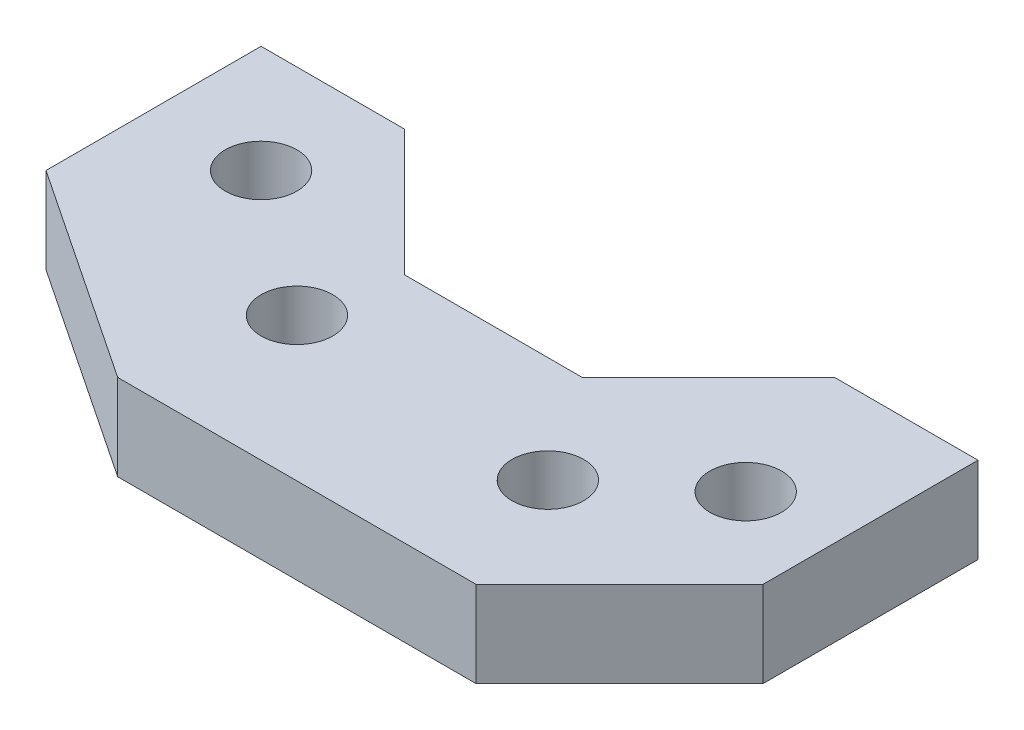
ISO-10303-21;
HEADER;
FILE_DESCRIPTION(('STEP AP214'),'2;1');
FILE_NAME('part.step','',(''),(''),'','','');
FILE_SCHEMA(('AUTOMOTIVE_DESIGN { 1 0 10303 214 1 1 1 1 }'));
ENDSEC;
DATA;
#1=APPLICATION_CONTEXT('core data for automotive mechanical design processes');
#2=APPLICATION_PROTOCOL_DEFINITION('international standard','automotive_design',2000,#1);
#3=PRODUCT_CONTEXT('',#1,'mechanical');
#4=PRODUCT('Part','Part','',(#3));
#5=PRODUCT_RELATED_PRODUCT_CATEGORY('part','',(#4));
#6=PRODUCT_DEFINITION_FORMATION('','',#4);
#7=PRODUCT_DEFINITION_CONTEXT('part definition',#1,'design');
#8=PRODUCT_DEFINITION('design','',#6,#7);
#9=PRODUCT_DEFINITION_SHAPE('','',#8);
#10=(LENGTH_UNIT() NAMED_UNIT(*) SI_UNIT(.MILLI.,.METRE.));
#11=(NAMED_UNIT(*) PLANE_ANGLE_UNIT() SI_UNIT($,.RADIAN.));
#12=(NAMED_UNIT(*) SI_UNIT($,.STERADIAN.) SOLID_ANGLE_UNIT());
#13=UNCERTAINTY_MEASURE_WITH_UNIT(LENGTH_MEASURE(1.E-05),#10,'distance_accuracy_value','');
#14=(GEOMETRIC_REPRESENTATION_CONTEXT(3) GLOBAL_UNCERTAINTY_ASSIGNED_CONTEXT((#13)) GLOBAL_UNIT_ASSIGNED_CONTEXT((#10,
#11,#12)) REPRESENTATION_CONTEXT('',''));
#15=CARTESIAN_POINT('',(0.,0.,0.));
#16=DIRECTION('',(0.,0.,1.));
#17=DIRECTION('',(1.,0.,0.));
#18=AXIS2_PLACEMENT_3D('',#15,#16,#17);
#19=CARTESIAN_POINT('',(0.,15.24,0.));
#20=DIRECTION('',(0.,-1.,0.));
#21=DIRECTION('',(0.,0.,-1.));
#22=AXIS2_PLACEMENT_3D('',#19,#20,#21);
#23=PLANE('',#22);
#24=DIRECTION('',(-1.,0.,0.));
#25=VECTOR('',#24,1.);
#26=CARTESIAN_POINT('',(0.,15.24,0.));
#27=LINE('',#26,#25);
#28=CARTESIAN_POINT('',(25.4,15.24,0.));
#29=VERTEX_POINT('',#28);
#30=CARTESIAN_POINT('',(0.,15.24,0.));
#31=VERTEX_POINT('',#30);
#32=EDGE_CURVE('E164',#29,#31,#27,.T.);
#33=ORIENTED_EDGE('',*,*,#32,.T.);
#34=DIRECTION('',(0.,0.,1.));
#35=VECTOR('',#34,1.);
#36=CARTESIAN_POINT('',(0.,15.24,0.));
#37=LINE('',#36,#35);
#38=CARTESIAN_POINT('',(0.,15.24,38.1));
#39=VERTEX_POINT('',#38);
#40=EDGE_CURVE('E102',#31,#39,#37,.T.);
#41=ORIENTED_EDGE('',*,*,#40,.T.);
#42=DIRECTION('',(0.832050294337844,0.,0.554700196225229));
#43=VECTOR('',#42,1.);
#44=CARTESIAN_POINT('',(0.,15.24,38.1));
#45=LINE('',#44,#43);
#46=CARTESIAN_POINT('',(38.1,15.24,63.5));
#47=VERTEX_POINT('',#46);
#48=EDGE_CURVE('E185',#39,#47,#45,.T.);
#49=ORIENTED_EDGE('',*,*,#48,.T.);
#50=DIRECTION('',(1.,0.,0.));
#51=VECTOR('',#50,1.);
#52=CARTESIAN_POINT('',(38.1,15.24,63.5));
#53=LINE('',#52,#51);
#54=CARTESIAN_POINT('',(101.6,15.24,63.5));
#55=VERTEX_POINT('',#54);
#56=EDGE_CURVE('E204',#47,#55,#53,.T.);
#57=ORIENTED_EDGE('',*,*,#56,.T.);
#58=DIRECTION('',(0.707106781186546,0.,-0.707106781186548));
#59=VECTOR('',#58,1.);
#60=CARTESIAN_POINT('',(101.6,15.24,63.5));
#61=LINE('',#60,#59);
#62=CARTESIAN_POINT('',(127.,15.24,38.1));
#63=VERTEX_POINT('',#62);
#64=EDGE_CURVE('E201',#55,#63,#61,.T.);
#65=ORIENTED_EDGE('',*,*,#64,.T.);
#66=DIRECTION('',(0.,0.,-1.));
#67=VECTOR('',#66,1.);
#68=CARTESIAN_POINT('',(127.,15.24,0.));
#69=LINE('',#68,#67);
#70=CARTESIAN_POINT('',(127.,15.24,0.));
#71=VERTEX_POINT('',#70);
#72=EDGE_CURVE('E203',#63,#71,#69,.T.);
#73=ORIENTED_EDGE('',*,*,#72,.T.);
#74=DIRECTION('',(-1.,0.,0.));
#75=VECTOR('',#74,1.);
#76=CARTESIAN_POINT('',(127.,15.24,0.));
#77=LINE('',#76,#75);
#78=CARTESIAN_POINT('',(101.6,15.24,0.));
#79=VERTEX_POINT('',#78);
#80=EDGE_CURVE('E127',#71,#79,#77,.T.);
#81=ORIENTED_EDGE('',*,*,#80,.T.);
#82=DIRECTION('',(-0.707106781186548,0.,0.707106781186547));
#83=VECTOR('',#82,1.);
#84=CARTESIAN_POINT('',(79.248,15.24,22.352));
#85=LINE('',#84,#83);
#86=CARTESIAN_POINT('',(79.248,15.24,22.352));
#87=VERTEX_POINT('',#86);
#88=EDGE_CURVE('E121',#79,#87,#85,.T.);
#89=ORIENTED_EDGE('',*,*,#88,.T.);
#90=DIRECTION('',(-1.,0.,0.));
#91=VECTOR('',#90,1.);
#92=CARTESIAN_POINT('',(47.752,15.24,22.352));
#93=LINE('',#92,#91);
#94=CARTESIAN_POINT('',(47.752,15.24,22.352));
#95=VERTEX_POINT('',#94);
#96=EDGE_CURVE('E125',#87,#95,#93,.T.);
#97=ORIENTED_EDGE('',*,*,#96,.T.);
#98=DIRECTION('',(-0.707106781186547,0.,-0.707106781186547));
#99=VECTOR('',#98,1.);
#100=CARTESIAN_POINT('',(25.4,15.24,0.));
#101=LINE('',#100,#99);
#102=EDGE_CURVE('E53',#95,#29,#101,.T.);
#103=ORIENTED_EDGE('',*,*,#102,.T.);
#104=EDGE_LOOP('',(#33,#41,#49,#57,#65,#73,#81,#89,#97,#103));
#105=FACE_BOUND('',#104,.T.);
#106=CARTESIAN_POINT('',(111.252,15.24,25.4));
#107=DIRECTION('',(0.,1.,0.));
#108=DIRECTION('',(0.,0.,1.));
#109=AXIS2_PLACEMENT_3D('',#106,#107,#108);
#110=CIRCLE('',#109,6.35);
#111=CARTESIAN_POINT('',(111.252,15.24,31.75));
#112=VERTEX_POINT('',#111);
#113=EDGE_CURVE('E149',#112,#112,#110,.T.);
#114=ORIENTED_EDGE('',*,*,#113,.F.);
#115=EDGE_LOOP('',(#114));
#116=FACE_BOUND('',#115,.T.);
#117=CARTESIAN_POINT('',(19.05,15.24,19.05));
#118=DIRECTION('',(0.,1.,0.));
#119=DIRECTION('',(0.,0.,1.));
#120=AXIS2_PLACEMENT_3D('',#117,#118,#119);
#121=CIRCLE('',#120,6.35);
#122=CARTESIAN_POINT('',(19.05,15.24,25.4));
#123=VERTEX_POINT('',#122);
#124=EDGE_CURVE('E215',#123,#123,#121,.T.);
#125=ORIENTED_EDGE('',*,*,#124,.F.);
#126=EDGE_LOOP('',(#125));
#127=FACE_BOUND('',#126,.T.);
#128=CARTESIAN_POINT('',(44.45,15.24,38.1));
#129=DIRECTION('',(0.,1.,0.));
#130=DIRECTION('',(0.,0.,1.));
#131=AXIS2_PLACEMENT_3D('',#128,#129,#130);
#132=CIRCLE('',#131,6.35);
#133=CARTESIAN_POINT('',(44.45,15.24,44.45));
#134=VERTEX_POINT('',#133);
#135=EDGE_CURVE('E221',#134,#134,#132,.T.);
#136=ORIENTED_EDGE('',*,*,#135,.F.);
#137=EDGE_LOOP('',(#136));
#138=FACE_BOUND('',#137,.T.);
#139=CARTESIAN_POINT('',(91.948,15.24,41.148));
#140=DIRECTION('',(0.,1.,0.));
#141=DIRECTION('',(0.,0.,1.));
#142=AXIS2_PLACEMENT_3D('',#139,#140,#141);
#143=CIRCLE('',#142,6.35);
#144=CARTESIAN_POINT('',(91.948,15.24,47.498));
#145=VERTEX_POINT('',#144);
#146=EDGE_CURVE('E227',#145,#145,#143,.T.);
#147=ORIENTED_EDGE('',*,*,#146,.F.);
#148=EDGE_LOOP('',(#147));
#149=FACE_BOUND('',#148,.T.);
#150=ADVANCED_FACE('F36',(#105,#116,#127,#138,#149),#23,.F.);
#151=CARTESIAN_POINT('',(0.,0.,0.));
#152=DIRECTION('',(0.,-1.,0.));
#153=DIRECTION('',(0.,0.,-1.));
#154=AXIS2_PLACEMENT_3D('',#151,#152,#153);
#155=PLANE('',#154);
#156=CARTESIAN_POINT('',(44.45,0.,38.1));
#157=DIRECTION('',(0.,1.,0.));
#158=DIRECTION('',(0.,0.,1.));
#159=AXIS2_PLACEMENT_3D('',#156,#157,#158);
#160=CIRCLE('',#159,6.35);
#161=CARTESIAN_POINT('',(44.45,0.,44.45));
#162=VERTEX_POINT('',#161);
#163=EDGE_CURVE('E224',#162,#162,#160,.T.);
#164=ORIENTED_EDGE('',*,*,#163,.T.);
#165=EDGE_LOOP('',(#164));
#166=FACE_BOUND('',#165,.T.);
#167=CARTESIAN_POINT('',(111.252,0.,25.4));
#168=DIRECTION('',(0.,1.,0.));
#169=DIRECTION('',(0.,0.,1.));
#170=AXIS2_PLACEMENT_3D('',#167,#168,#169);
#171=CIRCLE('',#170,6.35);
#172=CARTESIAN_POINT('',(111.252,0.,31.75));
#173=VERTEX_POINT('',#172);
#174=EDGE_CURVE('E212',#173,#173,#171,.T.);
#175=ORIENTED_EDGE('',*,*,#174,.T.);
#176=EDGE_LOOP('',(#175));
#177=FACE_BOUND('',#176,.T.);
#178=DIRECTION('',(-1.,0.,0.));
#179=VECTOR('',#178,1.);
#180=CARTESIAN_POINT('',(0.,0.,0.));
#181=LINE('',#180,#179);
#182=CARTESIAN_POINT('',(25.4,0.,0.));
#183=VERTEX_POINT('',#182);
#184=CARTESIAN_POINT('',(0.,0.,0.));
#185=VERTEX_POINT('',#184);
#186=EDGE_CURVE('E145',#183,#185,#181,.T.);
#187=ORIENTED_EDGE('',*,*,#186,.F.);
#188=DIRECTION('',(-0.707106781186547,0.,-0.707106781186547));
#189=VECTOR('',#188,1.);
#190=CARTESIAN_POINT('',(25.4,0.,0.));
#191=LINE('',#190,#189);
#192=CARTESIAN_POINT('',(47.752,0.,22.352));
#193=VERTEX_POINT('',#192);
#194=EDGE_CURVE('E94',#193,#183,#191,.T.);
#195=ORIENTED_EDGE('',*,*,#194,.F.);
#196=DIRECTION('',(-1.,0.,0.));
#197=VECTOR('',#196,1.);
#198=CARTESIAN_POINT('',(47.752,0.,22.352));
#199=LINE('',#198,#197);
#200=CARTESIAN_POINT('',(79.248,0.,22.352));
#201=VERTEX_POINT('',#200);
#202=EDGE_CURVE('E88',#201,#193,#199,.T.);
#203=ORIENTED_EDGE('',*,*,#202,.F.);
#204=DIRECTION('',(-0.707106781186548,0.,0.707106781186547));
#205=VECTOR('',#204,1.);
#206=CARTESIAN_POINT('',(79.248,0.,22.352));
#207=LINE('',#206,#205);
#208=CARTESIAN_POINT('',(101.6,0.,0.));
#209=VERTEX_POINT('',#208);
#210=EDGE_CURVE('E135',#209,#201,#207,.T.);
#211=ORIENTED_EDGE('',*,*,#210,.F.);
#212=DIRECTION('',(-1.,0.,0.));
#213=VECTOR('',#212,1.);
#214=CARTESIAN_POINT('',(127.,0.,0.));
#215=LINE('',#214,#213);
#216=CARTESIAN_POINT('',(127.,0.,0.));
#217=VERTEX_POINT('',#216);
#218=EDGE_CURVE('E159',#217,#209,#215,.T.);
#219=ORIENTED_EDGE('',*,*,#218,.F.);
#220=DIRECTION('',(0.,0.,-1.));
#221=VECTOR('',#220,1.);
#222=CARTESIAN_POINT('',(127.,0.,0.));
#223=LINE('',#222,#221);
#224=CARTESIAN_POINT('',(127.,0.,38.1));
#225=VERTEX_POINT('',#224);
#226=EDGE_CURVE('E157',#225,#217,#223,.T.);
#227=ORIENTED_EDGE('',*,*,#226,.F.);
#228=DIRECTION('',(0.707106781186546,0.,-0.707106781186548));
#229=VECTOR('',#228,1.);
#230=CARTESIAN_POINT('',(101.6,0.,63.5));
#231=LINE('',#230,#229);
#232=CARTESIAN_POINT('',(101.6,0.,63.5));
#233=VERTEX_POINT('',#232);
#234=EDGE_CURVE('E155',#233,#225,#231,.T.);
#235=ORIENTED_EDGE('',*,*,#234,.F.);
#236=DIRECTION('',(1.,0.,0.));
#237=VECTOR('',#236,1.);
#238=CARTESIAN_POINT('',(38.1,0.,63.5));
#239=LINE('',#238,#237);
#240=CARTESIAN_POINT('',(38.1,0.,63.5));
#241=VERTEX_POINT('',#240);
#242=EDGE_CURVE('E153',#241,#233,#239,.T.);
#243=ORIENTED_EDGE('',*,*,#242,.F.);
#244=DIRECTION('',(0.832050294337844,0.,0.554700196225229));
#245=VECTOR('',#244,1.);
#246=CARTESIAN_POINT('',(0.,0.,38.1));
#247=LINE('',#246,#245);
#248=CARTESIAN_POINT('',(0.,0.,38.1));
#249=VERTEX_POINT('',#248);
#250=EDGE_CURVE('E151',#249,#241,#247,.T.);
#251=ORIENTED_EDGE('',*,*,#250,.F.);
#252=DIRECTION('',(0.,0.,1.));
#253=VECTOR('',#252,1.);
#254=CARTESIAN_POINT('',(0.,0.,0.));
#255=LINE('',#254,#253);
#256=EDGE_CURVE('E148',#185,#249,#255,.T.);
#257=ORIENTED_EDGE('',*,*,#256,.F.);
#258=EDGE_LOOP('',(#187,#195,#203,#211,#219,#227,#235,#243,#251,#257));
#259=FACE_BOUND('',#258,.T.);
#260=CARTESIAN_POINT('',(19.05,0.,19.05));
#261=DIRECTION('',(0.,1.,0.));
#262=DIRECTION('',(0.,0.,1.));
#263=AXIS2_PLACEMENT_3D('',#260,#261,#262);
#264=CIRCLE('',#263,6.35);
#265=CARTESIAN_POINT('',(19.05,0.,25.4));
#266=VERTEX_POINT('',#265);
#267=EDGE_CURVE('E218',#266,#266,#264,.T.);
#268=ORIENTED_EDGE('',*,*,#267,.T.);
#269=EDGE_LOOP('',(#268));
#270=FACE_BOUND('',#269,.T.);
#271=CARTESIAN_POINT('',(91.948,0.,41.148));
#272=DIRECTION('',(0.,1.,0.));
#273=DIRECTION('',(0.,0.,1.));
#274=AXIS2_PLACEMENT_3D('',#271,#272,#273);
#275=CIRCLE('',#274,6.35);
#276=CARTESIAN_POINT('',(91.948,0.,47.498));
#277=VERTEX_POINT('',#276);
#278=EDGE_CURVE('E230',#277,#277,#275,.T.);
#279=ORIENTED_EDGE('',*,*,#278,.T.);
#280=EDGE_LOOP('',(#279));
#281=FACE_BOUND('',#280,.T.);
#282=ADVANCED_FACE('F189',(#166,#177,#259,#270,#281),#155,.T.);
#283=CARTESIAN_POINT('',(0.,15.24,0.));
#284=DIRECTION('',(0.,0.,1.));
#285=DIRECTION('',(1.,0.,0.));
#286=AXIS2_PLACEMENT_3D('',#283,#284,#285);
#287=PLANE('',#286);
#288=ORIENTED_EDGE('',*,*,#186,.T.);
#289=DIRECTION('',(0.,-1.,0.));
#290=VECTOR('',#289,1.);
#291=CARTESIAN_POINT('',(0.,15.24,0.));
#292=LINE('',#291,#290);
#293=EDGE_CURVE('E11',#31,#185,#292,.T.);
#294=ORIENTED_EDGE('',*,*,#293,.F.);
#295=ORIENTED_EDGE('',*,*,#32,.F.);
#296=DIRECTION('',(0.,-1.,0.));
#297=VECTOR('',#296,1.);
#298=CARTESIAN_POINT('',(25.4,15.24,0.));
#299=LINE('',#298,#297);
#300=EDGE_CURVE('E141',#29,#183,#299,.T.);
#301=ORIENTED_EDGE('',*,*,#300,.T.);
#302=EDGE_LOOP('',(#288,#294,#295,#301));
#303=FACE_BOUND('',#302,.T.);
#304=ADVANCED_FACE('F38',(#303),#287,.F.);
#305=CARTESIAN_POINT('',(0.,15.24,0.));
#306=DIRECTION('',(1.,0.,0.));
#307=DIRECTION('',(0.,0.,-1.));
#308=AXIS2_PLACEMENT_3D('',#305,#306,#307);
#309=PLANE('',#308);
#310=ORIENTED_EDGE('',*,*,#256,.T.);
#311=DIRECTION('',(0.,-1.,0.));
#312=VECTOR('',#311,1.);
#313=CARTESIAN_POINT('',(0.,15.24,38.1));
#314=LINE('',#313,#312);
#315=EDGE_CURVE('E45',#39,#249,#314,.T.);
#316=ORIENTED_EDGE('',*,*,#315,.F.);
#317=ORIENTED_EDGE('',*,*,#40,.F.);
#318=ORIENTED_EDGE('',*,*,#293,.T.);
#319=EDGE_LOOP('',(#310,#316,#317,#318));
#320=FACE_BOUND('',#319,.T.);
#321=ADVANCED_FACE('F270',(#320),#309,.F.);
#322=CARTESIAN_POINT('',(0.,15.24,38.1));
#323=DIRECTION('',(0.554700196225229,0.,-0.832050294337844));
#324=DIRECTION('',(-0.832050294337844,0.,-0.554700196225229));
#325=AXIS2_PLACEMENT_3D('',#322,#323,#324);
#326=PLANE('',#325);
#327=ORIENTED_EDGE('',*,*,#250,.T.);
#328=DIRECTION('',(0.,-1.,0.));
#329=VECTOR('',#328,1.);
#330=CARTESIAN_POINT('',(38.1,15.24,63.5));
#331=LINE('',#330,#329);
#332=EDGE_CURVE('E177',#47,#241,#331,.T.);
#333=ORIENTED_EDGE('',*,*,#332,.F.);
#334=ORIENTED_EDGE('',*,*,#48,.F.);
#335=ORIENTED_EDGE('',*,*,#315,.T.);
#336=EDGE_LOOP('',(#327,#333,#334,#335));
#337=FACE_BOUND('',#336,.T.);
#338=ADVANCED_FACE('F183',(#337),#326,.F.);
#339=CARTESIAN_POINT('',(38.1,15.24,63.5));
#340=DIRECTION('',(0.,0.,-1.));
#341=DIRECTION('',(-1.,0.,0.));
#342=AXIS2_PLACEMENT_3D('',#339,#340,#341);
#343=PLANE('',#342);
#344=ORIENTED_EDGE('',*,*,#242,.T.);
#345=DIRECTION('',(0.,-1.,0.));
#346=VECTOR('',#345,1.);
#347=CARTESIAN_POINT('',(101.6,15.24,63.5));
#348=LINE('',#347,#346);
#349=EDGE_CURVE('E174',#55,#233,#348,.T.);
#350=ORIENTED_EDGE('',*,*,#349,.F.);
#351=ORIENTED_EDGE('',*,*,#56,.F.);
#352=ORIENTED_EDGE('',*,*,#332,.T.);
#353=EDGE_LOOP('',(#344,#350,#351,#352));
#354=FACE_BOUND('',#353,.T.);
#355=ADVANCED_FACE('F195',(#354),#343,.F.);
#356=CARTESIAN_POINT('',(101.6,15.24,63.5));
#357=DIRECTION('',(-0.707106781186549,0.,-0.707106781186547));
#358=DIRECTION('',(-0.707106781186547,0.,0.707106781186549));
#359=AXIS2_PLACEMENT_3D('',#356,#357,#358);
#360=PLANE('',#359);
#361=ORIENTED_EDGE('',*,*,#234,.T.);
#362=DIRECTION('',(0.,-1.,0.));
#363=VECTOR('',#362,1.);
#364=CARTESIAN_POINT('',(127.,15.24,38.1));
#365=LINE('',#364,#363);
#366=EDGE_CURVE('E171',#63,#225,#365,.T.);
#367=ORIENTED_EDGE('',*,*,#366,.F.);
#368=ORIENTED_EDGE('',*,*,#64,.F.);
#369=ORIENTED_EDGE('',*,*,#349,.T.);
#370=EDGE_LOOP('',(#361,#367,#368,#369));
#371=FACE_BOUND('',#370,.T.);
#372=ADVANCED_FACE('F199',(#371),#360,.F.);
#373=CARTESIAN_POINT('',(127.,15.24,0.));
#374=DIRECTION('',(-1.,0.,0.));
#375=DIRECTION('',(0.,0.,1.));
#376=AXIS2_PLACEMENT_3D('',#373,#374,#375);
#377=PLANE('',#376);
#378=ORIENTED_EDGE('',*,*,#226,.T.);
#379=DIRECTION('',(0.,-1.,0.));
#380=VECTOR('',#379,1.);
#381=CARTESIAN_POINT('',(127.,15.24,0.));
#382=LINE('',#381,#380);
#383=EDGE_CURVE('E168',#71,#217,#382,.T.);
#384=ORIENTED_EDGE('',*,*,#383,.F.);
#385=ORIENTED_EDGE('',*,*,#72,.F.);
#386=ORIENTED_EDGE('',*,*,#366,.T.);
#387=EDGE_LOOP('',(#378,#384,#385,#386));
#388=FACE_BOUND('',#387,.T.);
#389=ADVANCED_FACE('F260',(#388),#377,.F.);
#390=CARTESIAN_POINT('',(127.,15.24,0.));
#391=DIRECTION('',(0.,0.,1.));
#392=DIRECTION('',(1.,0.,0.));
#393=AXIS2_PLACEMENT_3D('',#390,#391,#392);
#394=PLANE('',#393);
#395=ORIENTED_EDGE('',*,*,#218,.T.);
#396=DIRECTION('',(0.,-1.,0.));
#397=VECTOR('',#396,1.);
#398=CARTESIAN_POINT('',(101.6,15.24,0.));
#399=LINE('',#398,#397);
#400=EDGE_CURVE('E136',#79,#209,#399,.T.);
#401=ORIENTED_EDGE('',*,*,#400,.F.);
#402=ORIENTED_EDGE('',*,*,#80,.F.);
#403=ORIENTED_EDGE('',*,*,#383,.T.);
#404=EDGE_LOOP('',(#395,#401,#402,#403));
#405=FACE_BOUND('',#404,.T.);
#406=ADVANCED_FACE('F257',(#405),#394,.F.);
#407=CARTESIAN_POINT('',(79.248,15.24,22.352));
#408=DIRECTION('',(0.707106781186547,0.,0.707106781186548));
#409=DIRECTION('',(0.707106781186548,0.,-0.707106781186547));
#410=AXIS2_PLACEMENT_3D('',#407,#408,#409);
#411=PLANE('',#410);
#412=ORIENTED_EDGE('',*,*,#210,.T.);
#413=DIRECTION('',(0.,-1.,0.));
#414=VECTOR('',#413,1.);
#415=CARTESIAN_POINT('',(79.248,15.24,22.352));
#416=LINE('',#415,#414);
#417=EDGE_CURVE('E132',#87,#201,#416,.T.);
#418=ORIENTED_EDGE('',*,*,#417,.F.);
#419=ORIENTED_EDGE('',*,*,#88,.F.);
#420=ORIENTED_EDGE('',*,*,#400,.T.);
#421=EDGE_LOOP('',(#412,#418,#419,#420));
#422=FACE_BOUND('',#421,.T.);
#423=ADVANCED_FACE('F133',(#422),#411,.F.);
#424=CARTESIAN_POINT('',(47.752,15.24,22.352));
#425=DIRECTION('',(0.,0.,1.));
#426=DIRECTION('',(1.,0.,0.));
#427=AXIS2_PLACEMENT_3D('',#424,#425,#426);
#428=PLANE('',#427);
#429=ORIENTED_EDGE('',*,*,#202,.T.);
#430=DIRECTION('',(0.,-1.,0.));
#431=VECTOR('',#430,1.);
#432=CARTESIAN_POINT('',(47.752,15.24,22.352));
#433=LINE('',#432,#431);
#434=EDGE_CURVE('E137',#95,#193,#433,.T.);
#435=ORIENTED_EDGE('',*,*,#434,.F.);
#436=ORIENTED_EDGE('',*,*,#96,.F.);
#437=ORIENTED_EDGE('',*,*,#417,.T.);
#438=EDGE_LOOP('',(#429,#435,#436,#437));
#439=FACE_BOUND('',#438,.T.);
#440=ADVANCED_FACE('F139',(#439),#428,.F.);
#441=CARTESIAN_POINT('',(25.4,15.24,0.));
#442=DIRECTION('',(-0.707106781186547,0.,0.707106781186548));
#443=DIRECTION('',(0.707106781186548,0.,0.707106781186547));
#444=AXIS2_PLACEMENT_3D('',#441,#442,#443);
#445=PLANE('',#444);
#446=ORIENTED_EDGE('',*,*,#194,.T.);
#447=ORIENTED_EDGE('',*,*,#300,.F.);
#448=ORIENTED_EDGE('',*,*,#102,.F.);
#449=ORIENTED_EDGE('',*,*,#434,.T.);
#450=EDGE_LOOP('',(#446,#447,#448,#449));
#451=FACE_BOUND('',#450,.T.);
#452=ADVANCED_FACE('F250',(#451),#445,.F.);
#453=CARTESIAN_POINT('',(111.252,15.24,25.4));
#454=DIRECTION('',(0.,-1.,0.));
#455=DIRECTION('',(0.,0.,-1.));
#456=AXIS2_PLACEMENT_3D('',#453,#454,#455);
#457=CYLINDRICAL_SURFACE('',#456,6.35);
#458=ORIENTED_EDGE('',*,*,#113,.T.);
#459=EDGE_LOOP('',(#458));
#460=FACE_BOUND('',#459,.T.);
#461=ORIENTED_EDGE('',*,*,#174,.F.);
#462=EDGE_LOOP('',(#461));
#463=FACE_BOUND('',#462,.T.);
#464=ADVANCED_FACE('F247',(#460,#463),#457,.F.);
#465=CARTESIAN_POINT('',(19.05,15.24,19.05));
#466=DIRECTION('',(0.,-1.,0.));
#467=DIRECTION('',(0.,0.,-1.));
#468=AXIS2_PLACEMENT_3D('',#465,#466,#467);
#469=CYLINDRICAL_SURFACE('',#468,6.35);
#470=ORIENTED_EDGE('',*,*,#124,.T.);
#471=EDGE_LOOP('',(#470));
#472=FACE_BOUND('',#471,.T.);
#473=ORIENTED_EDGE('',*,*,#267,.F.);
#474=EDGE_LOOP('',(#473));
#475=FACE_BOUND('',#474,.T.);
#476=ADVANCED_FACE('F346',(#472,#475),#469,.F.);
#477=CARTESIAN_POINT('',(44.45,15.24,38.1));
#478=DIRECTION('',(0.,-1.,0.));
#479=DIRECTION('',(0.,0.,-1.));
#480=AXIS2_PLACEMENT_3D('',#477,#478,#479);
#481=CYLINDRICAL_SURFACE('',#480,6.35);
#482=ORIENTED_EDGE('',*,*,#135,.T.);
#483=EDGE_LOOP('',(#482));
#484=FACE_BOUND('',#483,.T.);
#485=ORIENTED_EDGE('',*,*,#163,.F.);
#486=EDGE_LOOP('',(#485));
#487=FACE_BOUND('',#486,.T.);
#488=ADVANCED_FACE('F354',(#484,#487),#481,.F.);
#489=CARTESIAN_POINT('',(91.948,15.24,41.148));
#490=DIRECTION('',(0.,-1.,0.));
#491=DIRECTION('',(0.,0.,-1.));
#492=AXIS2_PLACEMENT_3D('',#489,#490,#491);
#493=CYLINDRICAL_SURFACE('',#492,6.35);
#494=ORIENTED_EDGE('',*,*,#146,.T.);
#495=EDGE_LOOP('',(#494));
#496=FACE_BOUND('',#495,.T.);
#497=ORIENTED_EDGE('',*,*,#278,.F.);
#498=EDGE_LOOP('',(#497));
#499=FACE_BOUND('',#498,.T.);
#500=ADVANCED_FACE('F236',(#496,#499),#493,.F.);
#501=CLOSED_SHELL('',(#150,#282,#304,#321,#338,#355,#372,#389,#406,#423,#440,#452,#464,#476,
#488,#500));
#502=MANIFOLD_SOLID_BREP('B2',#501);
#503=ADVANCED_BREP_SHAPE_REPRESENTATION('',(#18,#502),#14);
#504=SHAPE_DEFINITION_REPRESENTATION(#9,#503);
ENDSEC;
END-ISO-10303-21;
